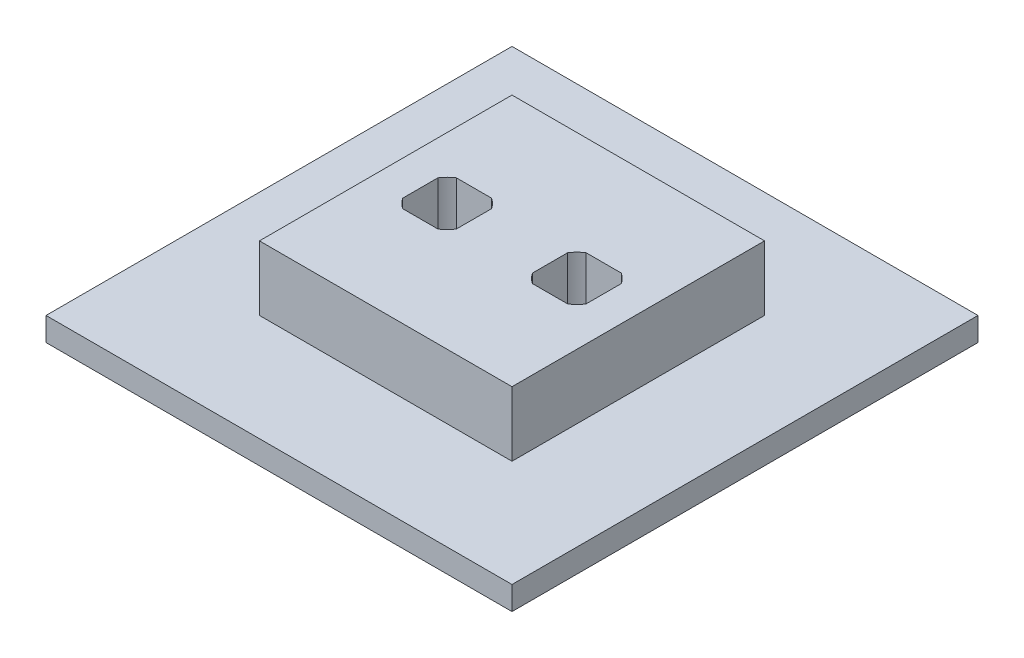
ISO-10303-21;
HEADER;
FILE_DESCRIPTION(('STEP AP214'),'2;1');
FILE_NAME('part.step','',(''),(''),'','','');
FILE_SCHEMA(('AUTOMOTIVE_DESIGN { 1 0 10303 214 1 1 1 1 }'));
ENDSEC;
DATA;
#1=APPLICATION_CONTEXT('core data for automotive mechanical design processes');
#2=APPLICATION_PROTOCOL_DEFINITION('international standard','automotive_design',2000,#1);
#3=PRODUCT_CONTEXT('',#1,'mechanical');
#4=PRODUCT('Part','Part','',(#3));
#5=PRODUCT_RELATED_PRODUCT_CATEGORY('part','',(#4));
#6=PRODUCT_DEFINITION_FORMATION('','',#4);
#7=PRODUCT_DEFINITION_CONTEXT('part definition',#1,'design');
#8=PRODUCT_DEFINITION('design','',#6,#7);
#9=PRODUCT_DEFINITION_SHAPE('','',#8);
#10=(LENGTH_UNIT() NAMED_UNIT(*) SI_UNIT(.MILLI.,.METRE.));
#11=(NAMED_UNIT(*) PLANE_ANGLE_UNIT() SI_UNIT($,.RADIAN.));
#12=(NAMED_UNIT(*) SI_UNIT($,.STERADIAN.) SOLID_ANGLE_UNIT());
#13=UNCERTAINTY_MEASURE_WITH_UNIT(LENGTH_MEASURE(1.E-05),#10,'distance_accuracy_value','');
#14=(GEOMETRIC_REPRESENTATION_CONTEXT(3) GLOBAL_UNCERTAINTY_ASSIGNED_CONTEXT((#13)) GLOBAL_UNIT_ASSIGNED_CONTEXT((#10,
#11,#12)) REPRESENTATION_CONTEXT('',''));
#15=CARTESIAN_POINT('',(0.,0.,0.));
#16=DIRECTION('',(0.,0.,1.));
#17=DIRECTION('',(1.,0.,0.));
#18=AXIS2_PLACEMENT_3D('',#15,#16,#17);
#19=CARTESIAN_POINT('',(28.6385,15.,-39.6875));
#20=DIRECTION('',(0.,-1.,0.));
#21=DIRECTION('',(0.,0.,-1.));
#22=AXIS2_PLACEMENT_3D('',#19,#20,#21);
#23=CYLINDRICAL_SURFACE('',#22,5.46099999999999);
#24=CARTESIAN_POINT('',(28.6385,15.,-39.6875));
#25=DIRECTION('',(0.,1.,0.));
#26=DIRECTION('',(0.,0.,1.));
#27=AXIS2_PLACEMENT_3D('',#24,#25,#26);
#28=CIRCLE('',#27,5.46099999999999);
#29=CARTESIAN_POINT('',(25.6352018130062,15.,-44.2485));
#30=VERTEX_POINT('',#29);
#31=CARTESIAN_POINT('',(24.0775,15.,-42.6907981869937));
#32=VERTEX_POINT('',#31);
#33=EDGE_CURVE('E358',#30,#32,#28,.T.);
#34=ORIENTED_EDGE('',*,*,#33,.T.);
#35=DIRECTION('',(0.,-1.,0.));
#36=VECTOR('',#35,1.);
#37=CARTESIAN_POINT('',(24.0775,15.,-42.6907981869937));
#38=LINE('',#37,#36);
#39=CARTESIAN_POINT('',(24.0775,0.,-42.6907981869937));
#40=VERTEX_POINT('',#39);
#41=EDGE_CURVE('E11',#32,#40,#38,.T.);
#42=ORIENTED_EDGE('',*,*,#41,.T.);
#43=CARTESIAN_POINT('',(28.6385,0.,-39.6875));
#44=DIRECTION('',(0.,1.,0.));
#45=DIRECTION('',(0.,0.,1.));
#46=AXIS2_PLACEMENT_3D('',#43,#44,#45);
#47=CIRCLE('',#46,5.46099999999998);
#48=CARTESIAN_POINT('',(25.6352018130063,0.,-44.2485));
#49=VERTEX_POINT('',#48);
#50=EDGE_CURVE('E414',#49,#40,#47,.T.);
#51=ORIENTED_EDGE('',*,*,#50,.F.);
#52=DIRECTION('',(0.,-1.,0.));
#53=VECTOR('',#52,1.);
#54=CARTESIAN_POINT('',(25.6352018130062,15.,-44.2485));
#55=LINE('',#54,#53);
#56=EDGE_CURVE('E336',#49,#30,#55,.F.);
#57=ORIENTED_EDGE('',*,*,#56,.T.);
#58=EDGE_LOOP('',(#34,#42,#51,#57));
#59=FACE_BOUND('',#58,.T.);
#60=ADVANCED_FACE('F38',(#59),#23,.F.);
#61=CARTESIAN_POINT('',(24.0775,0.,-36.6842018130063));
#62=VERTEX_POINT('',#61);
#63=CARTESIAN_POINT('',(25.6352018130062,0.,-35.1265));
#64=VERTEX_POINT('',#63);
#65=EDGE_CURVE('E229',#62,#64,#47,.T.);
#66=ORIENTED_EDGE('',*,*,#65,.F.);
#67=DIRECTION('',(0.,-1.,0.));
#68=VECTOR('',#67,1.);
#69=CARTESIAN_POINT('',(24.0775,15.,-36.6842018130062));
#70=LINE('',#69,#68);
#71=CARTESIAN_POINT('',(24.0775,15.,-36.6842018130062));
#72=VERTEX_POINT('',#71);
#73=EDGE_CURVE('E46',#62,#72,#70,.F.);
#74=ORIENTED_EDGE('',*,*,#73,.T.);
#75=CARTESIAN_POINT('',(25.6352018130062,15.,-35.1265));
#76=VERTEX_POINT('',#75);
#77=EDGE_CURVE('E238',#72,#76,#28,.T.);
#78=ORIENTED_EDGE('',*,*,#77,.T.);
#79=DIRECTION('',(0.,-1.,0.));
#80=VECTOR('',#79,1.);
#81=CARTESIAN_POINT('',(25.6352018130062,15.,-35.1265));
#82=LINE('',#81,#80);
#83=EDGE_CURVE('E327',#76,#64,#82,.T.);
#84=ORIENTED_EDGE('',*,*,#83,.T.);
#85=EDGE_LOOP('',(#66,#74,#78,#84));
#86=FACE_BOUND('',#85,.T.);
#87=ADVANCED_FACE('F346',(#86),#23,.F.);
#88=CARTESIAN_POINT('',(33.1995,15.,-42.6907981869937));
#89=VERTEX_POINT('',#88);
#90=CARTESIAN_POINT('',(31.6417981869937,15.,-44.2485));
#91=VERTEX_POINT('',#90);
#92=EDGE_CURVE('E244',#89,#91,#28,.T.);
#93=ORIENTED_EDGE('',*,*,#92,.T.);
#94=DIRECTION('',(0.,-1.,0.));
#95=VECTOR('',#94,1.);
#96=CARTESIAN_POINT('',(31.6417981869937,15.,-44.2485));
#97=LINE('',#96,#95);
#98=CARTESIAN_POINT('',(31.6417981869937,0.,-44.2485));
#99=VERTEX_POINT('',#98);
#100=EDGE_CURVE('E339',#91,#99,#97,.T.);
#101=ORIENTED_EDGE('',*,*,#100,.T.);
#102=CARTESIAN_POINT('',(33.1995,0.,-42.6907981869937));
#103=VERTEX_POINT('',#102);
#104=EDGE_CURVE('E412',#103,#99,#47,.T.);
#105=ORIENTED_EDGE('',*,*,#104,.F.);
#106=DIRECTION('',(0.,-1.,0.));
#107=VECTOR('',#106,1.);
#108=CARTESIAN_POINT('',(33.1995,15.,-42.6907981869937));
#109=LINE('',#108,#107);
#110=EDGE_CURVE('E330',#103,#89,#109,.F.);
#111=ORIENTED_EDGE('',*,*,#110,.T.);
#112=EDGE_LOOP('',(#93,#101,#105,#111));
#113=FACE_BOUND('',#112,.T.);
#114=ADVANCED_FACE('F363',(#113),#23,.F.);
#115=CARTESIAN_POINT('',(31.6417981869937,15.,-35.1265));
#116=VERTEX_POINT('',#115);
#117=CARTESIAN_POINT('',(33.1995,15.,-36.6842018130062));
#118=VERTEX_POINT('',#117);
#119=EDGE_CURVE('E240',#116,#118,#28,.T.);
#120=ORIENTED_EDGE('',*,*,#119,.T.);
#121=DIRECTION('',(0.,-1.,0.));
#122=VECTOR('',#121,1.);
#123=CARTESIAN_POINT('',(33.1995,15.,-36.6842018130062));
#124=LINE('',#123,#122);
#125=CARTESIAN_POINT('',(33.1995,0.,-36.6842018130062));
#126=VERTEX_POINT('',#125);
#127=EDGE_CURVE('E333',#118,#126,#124,.T.);
#128=ORIENTED_EDGE('',*,*,#127,.T.);
#129=CARTESIAN_POINT('',(31.6417981869937,0.,-35.1265));
#130=VERTEX_POINT('',#129);
#131=EDGE_CURVE('E233',#130,#126,#47,.T.);
#132=ORIENTED_EDGE('',*,*,#131,.F.);
#133=DIRECTION('',(0.,-1.,0.));
#134=VECTOR('',#133,1.);
#135=CARTESIAN_POINT('',(31.6417981869937,15.,-35.1265));
#136=LINE('',#135,#134);
#137=EDGE_CURVE('E324',#130,#116,#136,.F.);
#138=ORIENTED_EDGE('',*,*,#137,.T.);
#139=EDGE_LOOP('',(#120,#128,#132,#138));
#140=FACE_BOUND('',#139,.T.);
#141=ADVANCED_FACE('F432',(#140),#23,.F.);
#142=CARTESIAN_POINT('',(50.7365,15.,-39.6875));
#143=DIRECTION('',(0.,-1.,0.));
#144=DIRECTION('',(0.,0.,-1.));
#145=AXIS2_PLACEMENT_3D('',#142,#143,#144);
#146=CYLINDRICAL_SURFACE('',#145,5.46099999999998);
#147=CARTESIAN_POINT('',(50.7365,15.,-39.6875));
#148=DIRECTION('',(0.,1.,0.));
#149=DIRECTION('',(0.,0.,1.));
#150=AXIS2_PLACEMENT_3D('',#147,#148,#149);
#151=CIRCLE('',#150,5.46099999999998);
#152=CARTESIAN_POINT('',(47.7332018130063,15.,-44.2485));
#153=VERTEX_POINT('',#152);
#154=CARTESIAN_POINT('',(46.1755,15.,-42.6907981869937));
#155=VERTEX_POINT('',#154);
#156=EDGE_CURVE('E406',#153,#155,#151,.T.);
#157=ORIENTED_EDGE('',*,*,#156,.T.);
#158=DIRECTION('',(0.,-1.,0.));
#159=VECTOR('',#158,1.);
#160=CARTESIAN_POINT('',(46.1755,15.,-42.6907981869937));
#161=LINE('',#160,#159);
#162=CARTESIAN_POINT('',(46.1755,0.,-42.6907981869937));
#163=VERTEX_POINT('',#162);
#164=EDGE_CURVE('E321',#155,#163,#161,.T.);
#165=ORIENTED_EDGE('',*,*,#164,.T.);
#166=CARTESIAN_POINT('',(50.7365,0.,-39.6875));
#167=DIRECTION('',(0.,1.,0.));
#168=DIRECTION('',(0.,0.,1.));
#169=AXIS2_PLACEMENT_3D('',#166,#167,#168);
#170=CIRCLE('',#169,5.46099999999998);
#171=CARTESIAN_POINT('',(47.7332018130063,0.,-44.2485));
#172=VERTEX_POINT('',#171);
#173=EDGE_CURVE('E227',#172,#163,#170,.T.);
#174=ORIENTED_EDGE('',*,*,#173,.F.);
#175=DIRECTION('',(0.,-1.,0.));
#176=VECTOR('',#175,1.);
#177=CARTESIAN_POINT('',(47.7332018130063,15.,-44.2485));
#178=LINE('',#177,#176);
#179=EDGE_CURVE('E204',#172,#153,#178,.F.);
#180=ORIENTED_EDGE('',*,*,#179,.T.);
#181=EDGE_LOOP('',(#157,#165,#174,#180));
#182=FACE_BOUND('',#181,.T.);
#183=ADVANCED_FACE('F439',(#182),#146,.F.);
#184=CARTESIAN_POINT('',(46.1755,0.,-36.6842018130062));
#185=VERTEX_POINT('',#184);
#186=CARTESIAN_POINT('',(47.7332018130063,0.,-35.1265));
#187=VERTEX_POINT('',#186);
#188=EDGE_CURVE('E230',#185,#187,#170,.T.);
#189=ORIENTED_EDGE('',*,*,#188,.F.);
#190=DIRECTION('',(0.,-1.,0.));
#191=VECTOR('',#190,1.);
#192=CARTESIAN_POINT('',(46.1755,15.,-36.6842018130062));
#193=LINE('',#192,#191);
#194=CARTESIAN_POINT('',(46.1755,15.,-36.6842018130062));
#195=VERTEX_POINT('',#194);
#196=EDGE_CURVE('E220',#185,#195,#193,.F.);
#197=ORIENTED_EDGE('',*,*,#196,.T.);
#198=CARTESIAN_POINT('',(47.7332018130063,15.,-35.1265));
#199=VERTEX_POINT('',#198);
#200=EDGE_CURVE('E239',#195,#199,#151,.T.);
#201=ORIENTED_EDGE('',*,*,#200,.T.);
#202=DIRECTION('',(0.,-1.,0.));
#203=VECTOR('',#202,1.);
#204=CARTESIAN_POINT('',(47.7332018130063,15.,-35.1265));
#205=LINE('',#204,#203);
#206=EDGE_CURVE('E310',#199,#187,#205,.T.);
#207=ORIENTED_EDGE('',*,*,#206,.T.);
#208=EDGE_LOOP('',(#189,#197,#201,#207));
#209=FACE_BOUND('',#208,.T.);
#210=ADVANCED_FACE('F445',(#209),#146,.F.);
#211=CARTESIAN_POINT('',(55.2975,15.,-42.6907981869937));
#212=VERTEX_POINT('',#211);
#213=CARTESIAN_POINT('',(53.7397981869937,15.,-44.2485));
#214=VERTEX_POINT('',#213);
#215=EDGE_CURVE('E219',#212,#214,#151,.T.);
#216=ORIENTED_EDGE('',*,*,#215,.T.);
#217=DIRECTION('',(0.,-1.,0.));
#218=VECTOR('',#217,1.);
#219=CARTESIAN_POINT('',(53.7397981869937,15.,-44.2485));
#220=LINE('',#219,#218);
#221=CARTESIAN_POINT('',(53.7397981869937,0.,-44.2485));
#222=VERTEX_POINT('',#221);
#223=EDGE_CURVE('E201',#214,#222,#220,.T.);
#224=ORIENTED_EDGE('',*,*,#223,.T.);
#225=CARTESIAN_POINT('',(55.2975,0.,-42.6907981869937));
#226=VERTEX_POINT('',#225);
#227=EDGE_CURVE('E217',#226,#222,#170,.T.);
#228=ORIENTED_EDGE('',*,*,#227,.F.);
#229=DIRECTION('',(0.,-1.,0.));
#230=VECTOR('',#229,1.);
#231=CARTESIAN_POINT('',(55.2975,15.,-42.6907981869937));
#232=LINE('',#231,#230);
#233=EDGE_CURVE('E313',#226,#212,#232,.F.);
#234=ORIENTED_EDGE('',*,*,#233,.T.);
#235=EDGE_LOOP('',(#216,#224,#228,#234));
#236=FACE_BOUND('',#235,.T.);
#237=ADVANCED_FACE('F215',(#236),#146,.F.);
#238=CARTESIAN_POINT('',(53.7397981869937,15.,-35.1265));
#239=VERTEX_POINT('',#238);
#240=CARTESIAN_POINT('',(55.2975,15.,-36.6842018130063));
#241=VERTEX_POINT('',#240);
#242=EDGE_CURVE('E235',#239,#241,#151,.T.);
#243=ORIENTED_EDGE('',*,*,#242,.T.);
#244=DIRECTION('',(0.,-1.,0.));
#245=VECTOR('',#244,1.);
#246=CARTESIAN_POINT('',(55.2975,15.,-36.6842018130063));
#247=LINE('',#246,#245);
#248=CARTESIAN_POINT('',(55.2975,0.,-36.6842018130063));
#249=VERTEX_POINT('',#248);
#250=EDGE_CURVE('E315',#241,#249,#247,.T.);
#251=ORIENTED_EDGE('',*,*,#250,.T.);
#252=CARTESIAN_POINT('',(53.7397981869937,0.,-35.1265));
#253=VERTEX_POINT('',#252);
#254=EDGE_CURVE('E226',#253,#249,#170,.T.);
#255=ORIENTED_EDGE('',*,*,#254,.F.);
#256=DIRECTION('',(0.,-1.,0.));
#257=VECTOR('',#256,1.);
#258=CARTESIAN_POINT('',(53.7397981869937,15.,-35.1265));
#259=LINE('',#258,#257);
#260=EDGE_CURVE('E307',#253,#239,#259,.F.);
#261=ORIENTED_EDGE('',*,*,#260,.T.);
#262=EDGE_LOOP('',(#243,#251,#255,#261));
#263=FACE_BOUND('',#262,.T.);
#264=ADVANCED_FACE('F400',(#263),#146,.F.);
#265=CARTESIAN_POINT('',(0.,4.,0.));
#266=DIRECTION('',(1.,0.,0.));
#267=DIRECTION('',(0.,0.,-1.));
#268=AXIS2_PLACEMENT_3D('',#265,#266,#267);
#269=PLANE('',#268);
#270=DIRECTION('',(0.,0.,1.));
#271=VECTOR('',#270,1.);
#272=CARTESIAN_POINT('',(0.,0.,0.));
#273=LINE('',#272,#271);
#274=CARTESIAN_POINT('',(0.,0.,-79.375));
#275=VERTEX_POINT('',#274);
#276=CARTESIAN_POINT('',(0.,0.,0.));
#277=VERTEX_POINT('',#276);
#278=EDGE_CURVE('E277',#275,#277,#273,.T.);
#279=ORIENTED_EDGE('',*,*,#278,.T.);
#280=DIRECTION('',(0.,-1.,0.));
#281=VECTOR('',#280,1.);
#282=CARTESIAN_POINT('',(0.,4.,0.));
#283=LINE('',#282,#281);
#284=CARTESIAN_POINT('',(0.,4.,0.));
#285=VERTEX_POINT('',#284);
#286=EDGE_CURVE('E304',#285,#277,#283,.T.);
#287=ORIENTED_EDGE('',*,*,#286,.F.);
#288=DIRECTION('',(0.,0.,1.));
#289=VECTOR('',#288,1.);
#290=CARTESIAN_POINT('',(0.,4.,0.));
#291=LINE('',#290,#289);
#292=CARTESIAN_POINT('',(0.,4.,-79.375));
#293=VERTEX_POINT('',#292);
#294=EDGE_CURVE('E278',#293,#285,#291,.T.);
#295=ORIENTED_EDGE('',*,*,#294,.F.);
#296=DIRECTION('',(0.,-1.,0.));
#297=VECTOR('',#296,1.);
#298=CARTESIAN_POINT('',(0.,4.,-79.375));
#299=LINE('',#298,#297);
#300=EDGE_CURVE('E288',#293,#275,#299,.T.);
#301=ORIENTED_EDGE('',*,*,#300,.T.);
#302=EDGE_LOOP('',(#279,#287,#295,#301));
#303=FACE_BOUND('',#302,.T.);
#304=ADVANCED_FACE('F40',(#303),#269,.F.);
#305=CARTESIAN_POINT('',(0.,4.,0.));
#306=DIRECTION('',(0.,0.,-1.));
#307=DIRECTION('',(-1.,0.,0.));
#308=AXIS2_PLACEMENT_3D('',#305,#306,#307);
#309=PLANE('',#308);
#310=DIRECTION('',(1.,0.,0.));
#311=VECTOR('',#310,1.);
#312=CARTESIAN_POINT('',(0.,0.,0.));
#313=LINE('',#312,#311);
#314=CARTESIAN_POINT('',(79.375,0.,0.));
#315=VERTEX_POINT('',#314);
#316=EDGE_CURVE('E291',#277,#315,#313,.T.);
#317=ORIENTED_EDGE('',*,*,#316,.T.);
#318=DIRECTION('',(0.,-1.,0.));
#319=VECTOR('',#318,1.);
#320=CARTESIAN_POINT('',(79.375,4.,0.));
#321=LINE('',#320,#319);
#322=CARTESIAN_POINT('',(79.375,4.,0.));
#323=VERTEX_POINT('',#322);
#324=EDGE_CURVE('E301',#323,#315,#321,.T.);
#325=ORIENTED_EDGE('',*,*,#324,.F.);
#326=DIRECTION('',(1.,0.,0.));
#327=VECTOR('',#326,1.);
#328=CARTESIAN_POINT('',(0.,4.,0.));
#329=LINE('',#328,#327);
#330=EDGE_CURVE('E281',#285,#323,#329,.T.);
#331=ORIENTED_EDGE('',*,*,#330,.F.);
#332=ORIENTED_EDGE('',*,*,#286,.T.);
#333=EDGE_LOOP('',(#317,#325,#331,#332));
#334=FACE_BOUND('',#333,.T.);
#335=ADVANCED_FACE('F644',(#334),#309,.F.);
#336=CARTESIAN_POINT('',(79.375,4.,0.));
#337=DIRECTION('',(-1.,0.,0.));
#338=DIRECTION('',(0.,0.,1.));
#339=AXIS2_PLACEMENT_3D('',#336,#337,#338);
#340=PLANE('',#339);
#341=DIRECTION('',(0.,0.,-1.));
#342=VECTOR('',#341,1.);
#343=CARTESIAN_POINT('',(79.375,0.,0.));
#344=LINE('',#343,#342);
#345=CARTESIAN_POINT('',(79.375,0.,-79.375));
#346=VERTEX_POINT('',#345);
#347=EDGE_CURVE('E293',#315,#346,#344,.T.);
#348=ORIENTED_EDGE('',*,*,#347,.T.);
#349=DIRECTION('',(0.,-1.,0.));
#350=VECTOR('',#349,1.);
#351=CARTESIAN_POINT('',(79.375,4.,-79.375));
#352=LINE('',#351,#350);
#353=CARTESIAN_POINT('',(79.375,4.,-79.375));
#354=VERTEX_POINT('',#353);
#355=EDGE_CURVE('E298',#354,#346,#352,.T.);
#356=ORIENTED_EDGE('',*,*,#355,.F.);
#357=DIRECTION('',(0.,0.,-1.));
#358=VECTOR('',#357,1.);
#359=CARTESIAN_POINT('',(79.375,4.,0.));
#360=LINE('',#359,#358);
#361=EDGE_CURVE('E284',#323,#354,#360,.T.);
#362=ORIENTED_EDGE('',*,*,#361,.F.);
#363=ORIENTED_EDGE('',*,*,#324,.T.);
#364=EDGE_LOOP('',(#348,#356,#362,#363));
#365=FACE_BOUND('',#364,.T.);
#366=ADVANCED_FACE('F634',(#365),#340,.F.);
#367=CARTESIAN_POINT('',(0.,4.,-79.375));
#368=DIRECTION('',(0.,0.,1.));
#369=DIRECTION('',(1.,0.,0.));
#370=AXIS2_PLACEMENT_3D('',#367,#368,#369);
#371=PLANE('',#370);
#372=DIRECTION('',(-1.,0.,0.));
#373=VECTOR('',#372,1.);
#374=CARTESIAN_POINT('',(0.,0.,-79.375));
#375=LINE('',#374,#373);
#376=EDGE_CURVE('E282',#346,#275,#375,.T.);
#377=ORIENTED_EDGE('',*,*,#376,.T.);
#378=ORIENTED_EDGE('',*,*,#300,.F.);
#379=DIRECTION('',(-1.,0.,0.));
#380=VECTOR('',#379,1.);
#381=CARTESIAN_POINT('',(0.,4.,-79.375));
#382=LINE('',#381,#380);
#383=EDGE_CURVE('E286',#354,#293,#382,.T.);
#384=ORIENTED_EDGE('',*,*,#383,.F.);
#385=ORIENTED_EDGE('',*,*,#355,.T.);
#386=EDGE_LOOP('',(#377,#378,#384,#385));
#387=FACE_BOUND('',#386,.T.);
#388=ADVANCED_FACE('F624',(#387),#371,.F.);
#389=CARTESIAN_POINT('',(0.,4.,0.));
#390=DIRECTION('',(0.,-1.,0.));
#391=DIRECTION('',(0.,0.,-1.));
#392=AXIS2_PLACEMENT_3D('',#389,#390,#391);
#393=PLANE('',#392);
#394=DIRECTION('',(0.,0.,1.));
#395=VECTOR('',#394,1.);
#396=CARTESIAN_POINT('',(18.1775,4.,-18.1775));
#397=LINE('',#396,#395);
#398=CARTESIAN_POINT('',(18.1775,4.,-61.1975));
#399=VERTEX_POINT('',#398);
#400=CARTESIAN_POINT('',(18.1775,4.,-18.1775));
#401=VERTEX_POINT('',#400);
#402=EDGE_CURVE('E243',#399,#401,#397,.T.);
#403=ORIENTED_EDGE('',*,*,#402,.F.);
#404=DIRECTION('',(-1.,0.,0.));
#405=VECTOR('',#404,1.);
#406=CARTESIAN_POINT('',(18.1775,4.,-61.1975));
#407=LINE('',#406,#405);
#408=CARTESIAN_POINT('',(61.1975,4.,-61.1975));
#409=VERTEX_POINT('',#408);
#410=EDGE_CURVE('E249',#409,#399,#407,.T.);
#411=ORIENTED_EDGE('',*,*,#410,.F.);
#412=DIRECTION('',(0.,0.,-1.));
#413=VECTOR('',#412,1.);
#414=CARTESIAN_POINT('',(61.1975,4.,-18.1775));
#415=LINE('',#414,#413);
#416=CARTESIAN_POINT('',(61.1975,4.,-18.1775));
#417=VERTEX_POINT('',#416);
#418=EDGE_CURVE('E261',#417,#409,#415,.T.);
#419=ORIENTED_EDGE('',*,*,#418,.F.);
#420=DIRECTION('',(1.,0.,0.));
#421=VECTOR('',#420,1.);
#422=CARTESIAN_POINT('',(18.1775,4.,-18.1775));
#423=LINE('',#422,#421);
#424=EDGE_CURVE('E258',#401,#417,#423,.T.);
#425=ORIENTED_EDGE('',*,*,#424,.F.);
#426=EDGE_LOOP('',(#403,#411,#419,#425));
#427=FACE_BOUND('',#426,.T.);
#428=ORIENTED_EDGE('',*,*,#294,.T.);
#429=ORIENTED_EDGE('',*,*,#330,.T.);
#430=ORIENTED_EDGE('',*,*,#361,.T.);
#431=ORIENTED_EDGE('',*,*,#383,.T.);
#432=EDGE_LOOP('',(#428,#429,#430,#431));
#433=FACE_BOUND('',#432,.T.);
#434=ADVANCED_FACE('F521',(#427,#433),#393,.F.);
#435=CARTESIAN_POINT('',(0.,0.,0.));
#436=DIRECTION('',(0.,-1.,0.));
#437=DIRECTION('',(0.,0.,-1.));
#438=AXIS2_PLACEMENT_3D('',#435,#436,#437);
#439=PLANE('',#438);
#440=ORIENTED_EDGE('',*,*,#278,.F.);
#441=ORIENTED_EDGE('',*,*,#376,.F.);
#442=ORIENTED_EDGE('',*,*,#347,.F.);
#443=ORIENTED_EDGE('',*,*,#316,.F.);
#444=EDGE_LOOP('',(#440,#441,#442,#443));
#445=FACE_BOUND('',#444,.T.);
#446=DIRECTION('',(0.,0.,1.));
#447=VECTOR('',#446,1.);
#448=CARTESIAN_POINT('',(24.0775,0.,-35.1265));
#449=LINE('',#448,#447);
#450=EDGE_CURVE('E53',#40,#62,#449,.T.);
#451=ORIENTED_EDGE('',*,*,#450,.T.);
#452=ORIENTED_EDGE('',*,*,#65,.T.);
#453=DIRECTION('',(1.,0.,0.));
#454=VECTOR('',#453,1.);
#455=CARTESIAN_POINT('',(24.0775,0.,-35.1265));
#456=LINE('',#455,#454);
#457=EDGE_CURVE('E384',#64,#130,#456,.T.);
#458=ORIENTED_EDGE('',*,*,#457,.T.);
#459=ORIENTED_EDGE('',*,*,#131,.T.);
#460=DIRECTION('',(0.,0.,-1.));
#461=VECTOR('',#460,1.);
#462=CARTESIAN_POINT('',(33.1995,0.,-35.1265));
#463=LINE('',#462,#461);
#464=EDGE_CURVE('E386',#126,#103,#463,.T.);
#465=ORIENTED_EDGE('',*,*,#464,.T.);
#466=ORIENTED_EDGE('',*,*,#104,.T.);
#467=DIRECTION('',(-1.,0.,0.));
#468=VECTOR('',#467,1.);
#469=CARTESIAN_POINT('',(24.0775,0.,-44.2485));
#470=LINE('',#469,#468);
#471=EDGE_CURVE('E59',#99,#49,#470,.T.);
#472=ORIENTED_EDGE('',*,*,#471,.T.);
#473=ORIENTED_EDGE('',*,*,#50,.T.);
#474=EDGE_LOOP('',(#451,#452,#458,#459,#465,#466,#472,#473));
#475=FACE_BOUND('',#474,.T.);
#476=DIRECTION('',(0.,0.,1.));
#477=VECTOR('',#476,1.);
#478=CARTESIAN_POINT('',(46.1755,0.,-44.2485));
#479=LINE('',#478,#477);
#480=EDGE_CURVE('E209',#163,#185,#479,.T.);
#481=ORIENTED_EDGE('',*,*,#480,.T.);
#482=ORIENTED_EDGE('',*,*,#188,.T.);
#483=DIRECTION('',(1.,0.,0.));
#484=VECTOR('',#483,1.);
#485=CARTESIAN_POINT('',(46.1755,0.,-35.1265));
#486=LINE('',#485,#484);
#487=EDGE_CURVE('E388',#187,#253,#486,.T.);
#488=ORIENTED_EDGE('',*,*,#487,.T.);
#489=ORIENTED_EDGE('',*,*,#254,.T.);
#490=DIRECTION('',(0.,0.,-1.));
#491=VECTOR('',#490,1.);
#492=CARTESIAN_POINT('',(55.2975,0.,-44.2485));
#493=LINE('',#492,#491);
#494=EDGE_CURVE('E224',#249,#226,#493,.T.);
#495=ORIENTED_EDGE('',*,*,#494,.T.);
#496=ORIENTED_EDGE('',*,*,#227,.T.);
#497=DIRECTION('',(-1.,0.,0.));
#498=VECTOR('',#497,1.);
#499=CARTESIAN_POINT('',(46.1755,0.,-44.2485));
#500=LINE('',#499,#498);
#501=EDGE_CURVE('E198',#222,#172,#500,.T.);
#502=ORIENTED_EDGE('',*,*,#501,.T.);
#503=ORIENTED_EDGE('',*,*,#173,.T.);
#504=EDGE_LOOP('',(#481,#482,#488,#489,#495,#496,#502,#503));
#505=FACE_BOUND('',#504,.T.);
#506=ADVANCED_FACE('F222',(#445,#475,#505),#439,.T.);
#507=CARTESIAN_POINT('',(0.,15.,0.));
#508=DIRECTION('',(0.,-1.,0.));
#509=DIRECTION('',(0.,0.,-1.));
#510=AXIS2_PLACEMENT_3D('',#507,#508,#509);
#511=PLANE('',#510);
#512=DIRECTION('',(0.,0.,1.));
#513=VECTOR('',#512,1.);
#514=CARTESIAN_POINT('',(18.1775,15.,-18.1775));
#515=LINE('',#514,#513);
#516=CARTESIAN_POINT('',(18.1775,15.,-61.1975));
#517=VERTEX_POINT('',#516);
#518=CARTESIAN_POINT('',(18.1775,15.,-18.1775));
#519=VERTEX_POINT('',#518);
#520=EDGE_CURVE('E245',#517,#519,#515,.T.);
#521=ORIENTED_EDGE('',*,*,#520,.T.);
#522=DIRECTION('',(1.,0.,0.));
#523=VECTOR('',#522,1.);
#524=CARTESIAN_POINT('',(18.1775,15.,-18.1775));
#525=LINE('',#524,#523);
#526=CARTESIAN_POINT('',(61.1975,15.,-18.1775));
#527=VERTEX_POINT('',#526);
#528=EDGE_CURVE('E248',#519,#527,#525,.T.);
#529=ORIENTED_EDGE('',*,*,#528,.T.);
#530=DIRECTION('',(0.,0.,-1.));
#531=VECTOR('',#530,1.);
#532=CARTESIAN_POINT('',(61.1975,15.,-18.1775));
#533=LINE('',#532,#531);
#534=CARTESIAN_POINT('',(61.1975,15.,-61.1975));
#535=VERTEX_POINT('',#534);
#536=EDGE_CURVE('E251',#527,#535,#533,.T.);
#537=ORIENTED_EDGE('',*,*,#536,.T.);
#538=DIRECTION('',(-1.,0.,0.));
#539=VECTOR('',#538,1.);
#540=CARTESIAN_POINT('',(18.1775,15.,-61.1975));
#541=LINE('',#540,#539);
#542=EDGE_CURVE('E253',#535,#517,#541,.T.);
#543=ORIENTED_EDGE('',*,*,#542,.T.);
#544=EDGE_LOOP('',(#521,#529,#537,#543));
#545=FACE_BOUND('',#544,.T.);
#546=ORIENTED_EDGE('',*,*,#77,.F.);
#547=DIRECTION('',(0.,0.,1.));
#548=VECTOR('',#547,1.);
#549=CARTESIAN_POINT('',(24.0775,15.,-35.1265));
#550=LINE('',#549,#548);
#551=EDGE_CURVE('E354',#32,#72,#550,.T.);
#552=ORIENTED_EDGE('',*,*,#551,.F.);
#553=ORIENTED_EDGE('',*,*,#33,.F.);
#554=DIRECTION('',(-1.,0.,0.));
#555=VECTOR('',#554,1.);
#556=CARTESIAN_POINT('',(24.0775,15.,-44.2485));
#557=LINE('',#556,#555);
#558=EDGE_CURVE('E369',#91,#30,#557,.T.);
#559=ORIENTED_EDGE('',*,*,#558,.F.);
#560=ORIENTED_EDGE('',*,*,#92,.F.);
#561=DIRECTION('',(0.,0.,-1.));
#562=VECTOR('',#561,1.);
#563=CARTESIAN_POINT('',(33.1995,15.,-35.1265));
#564=LINE('',#563,#562);
#565=EDGE_CURVE('E368',#118,#89,#564,.T.);
#566=ORIENTED_EDGE('',*,*,#565,.F.);
#567=ORIENTED_EDGE('',*,*,#119,.F.);
#568=DIRECTION('',(1.,0.,0.));
#569=VECTOR('',#568,1.);
#570=CARTESIAN_POINT('',(24.0775,15.,-35.1265));
#571=LINE('',#570,#569);
#572=EDGE_CURVE('E357',#76,#116,#571,.T.);
#573=ORIENTED_EDGE('',*,*,#572,.F.);
#574=EDGE_LOOP('',(#546,#552,#553,#559,#560,#566,#567,#573));
#575=FACE_BOUND('',#574,.T.);
#576=ORIENTED_EDGE('',*,*,#200,.F.);
#577=DIRECTION('',(0.,0.,1.));
#578=VECTOR('',#577,1.);
#579=CARTESIAN_POINT('',(46.1755,15.,-44.2485));
#580=LINE('',#579,#578);
#581=EDGE_CURVE('E375',#155,#195,#580,.T.);
#582=ORIENTED_EDGE('',*,*,#581,.F.);
#583=ORIENTED_EDGE('',*,*,#156,.F.);
#584=DIRECTION('',(-1.,0.,0.));
#585=VECTOR('',#584,1.);
#586=CARTESIAN_POINT('',(46.1755,15.,-44.2485));
#587=LINE('',#586,#585);
#588=EDGE_CURVE('E377',#214,#153,#587,.T.);
#589=ORIENTED_EDGE('',*,*,#588,.F.);
#590=ORIENTED_EDGE('',*,*,#215,.F.);
#591=DIRECTION('',(0.,0.,-1.));
#592=VECTOR('',#591,1.);
#593=CARTESIAN_POINT('',(55.2975,15.,-44.2485));
#594=LINE('',#593,#592);
#595=EDGE_CURVE('E379',#241,#212,#594,.T.);
#596=ORIENTED_EDGE('',*,*,#595,.F.);
#597=ORIENTED_EDGE('',*,*,#242,.F.);
#598=DIRECTION('',(1.,0.,0.));
#599=VECTOR('',#598,1.);
#600=CARTESIAN_POINT('',(46.1755,15.,-35.1265));
#601=LINE('',#600,#599);
#602=EDGE_CURVE('E210',#199,#239,#601,.T.);
#603=ORIENTED_EDGE('',*,*,#602,.F.);
#604=EDGE_LOOP('',(#576,#582,#583,#589,#590,#596,#597,#603));
#605=FACE_BOUND('',#604,.T.);
#606=ADVANCED_FACE('F351',(#545,#575,#605),#511,.F.);
#607=CARTESIAN_POINT('',(18.1775,15.,-18.1775));
#608=DIRECTION('',(1.,0.,0.));
#609=DIRECTION('',(0.,0.,-1.));
#610=AXIS2_PLACEMENT_3D('',#607,#608,#609);
#611=PLANE('',#610);
#612=ORIENTED_EDGE('',*,*,#402,.T.);
#613=DIRECTION('',(0.,-1.,0.));
#614=VECTOR('',#613,1.);
#615=CARTESIAN_POINT('',(18.1775,15.,-18.1775));
#616=LINE('',#615,#614);
#617=EDGE_CURVE('E274',#519,#401,#616,.T.);
#618=ORIENTED_EDGE('',*,*,#617,.F.);
#619=ORIENTED_EDGE('',*,*,#520,.F.);
#620=DIRECTION('',(0.,-1.,0.));
#621=VECTOR('',#620,1.);
#622=CARTESIAN_POINT('',(18.1775,15.,-61.1975));
#623=LINE('',#622,#621);
#624=EDGE_CURVE('E255',#517,#399,#623,.T.);
#625=ORIENTED_EDGE('',*,*,#624,.T.);
#626=EDGE_LOOP('',(#612,#618,#619,#625));
#627=FACE_BOUND('',#626,.T.);
#628=ADVANCED_FACE('F510',(#627),#611,.F.);
#629=CARTESIAN_POINT('',(18.1775,15.,-18.1775));
#630=DIRECTION('',(0.,0.,-1.));
#631=DIRECTION('',(-1.,0.,0.));
#632=AXIS2_PLACEMENT_3D('',#629,#630,#631);
#633=PLANE('',#632);
#634=ORIENTED_EDGE('',*,*,#424,.T.);
#635=DIRECTION('',(0.,-1.,0.));
#636=VECTOR('',#635,1.);
#637=CARTESIAN_POINT('',(61.1975,15.,-18.1775));
#638=LINE('',#637,#636);
#639=EDGE_CURVE('E271',#527,#417,#638,.T.);
#640=ORIENTED_EDGE('',*,*,#639,.F.);
#641=ORIENTED_EDGE('',*,*,#528,.F.);
#642=ORIENTED_EDGE('',*,*,#617,.T.);
#643=EDGE_LOOP('',(#634,#640,#641,#642));
#644=FACE_BOUND('',#643,.T.);
#645=ADVANCED_FACE('F598',(#644),#633,.F.);
#646=CARTESIAN_POINT('',(61.1975,15.,-18.1775));
#647=DIRECTION('',(-1.,0.,0.));
#648=DIRECTION('',(0.,0.,1.));
#649=AXIS2_PLACEMENT_3D('',#646,#647,#648);
#650=PLANE('',#649);
#651=ORIENTED_EDGE('',*,*,#418,.T.);
#652=DIRECTION('',(0.,-1.,0.));
#653=VECTOR('',#652,1.);
#654=CARTESIAN_POINT('',(61.1975,15.,-61.1975));
#655=LINE('',#654,#653);
#656=EDGE_CURVE('E268',#535,#409,#655,.T.);
#657=ORIENTED_EDGE('',*,*,#656,.F.);
#658=ORIENTED_EDGE('',*,*,#536,.F.);
#659=ORIENTED_EDGE('',*,*,#639,.T.);
#660=EDGE_LOOP('',(#651,#657,#658,#659));
#661=FACE_BOUND('',#660,.T.);
#662=ADVANCED_FACE('F588',(#661),#650,.F.);
#663=CARTESIAN_POINT('',(18.1775,15.,-61.1975));
#664=DIRECTION('',(0.,0.,1.));
#665=DIRECTION('',(1.,0.,0.));
#666=AXIS2_PLACEMENT_3D('',#663,#664,#665);
#667=PLANE('',#666);
#668=ORIENTED_EDGE('',*,*,#410,.T.);
#669=ORIENTED_EDGE('',*,*,#624,.F.);
#670=ORIENTED_EDGE('',*,*,#542,.F.);
#671=ORIENTED_EDGE('',*,*,#656,.T.);
#672=EDGE_LOOP('',(#668,#669,#670,#671));
#673=FACE_BOUND('',#672,.T.);
#674=ADVANCED_FACE('F500',(#673),#667,.F.);
#675=CARTESIAN_POINT('',(46.1755,-42.7359786462698,-44.2485));
#676=DIRECTION('',(0.,0.,-1.));
#677=DIRECTION('',(-1.,0.,0.));
#678=AXIS2_PLACEMENT_3D('',#675,#676,#677);
#679=PLANE('',#678);
#680=ORIENTED_EDGE('',*,*,#223,.F.);
#681=ORIENTED_EDGE('',*,*,#588,.T.);
#682=ORIENTED_EDGE('',*,*,#179,.F.);
#683=ORIENTED_EDGE('',*,*,#501,.F.);
#684=EDGE_LOOP('',(#680,#681,#682,#683));
#685=FACE_BOUND('',#684,.T.);
#686=ADVANCED_FACE('F200',(#685),#679,.F.);
#687=CARTESIAN_POINT('',(46.1755,-42.7359786462698,-44.2485));
#688=DIRECTION('',(-1.,0.,0.));
#689=DIRECTION('',(0.,0.,1.));
#690=AXIS2_PLACEMENT_3D('',#687,#688,#689);
#691=PLANE('',#690);
#692=ORIENTED_EDGE('',*,*,#164,.F.);
#693=ORIENTED_EDGE('',*,*,#581,.T.);
#694=ORIENTED_EDGE('',*,*,#196,.F.);
#695=ORIENTED_EDGE('',*,*,#480,.F.);
#696=EDGE_LOOP('',(#692,#693,#694,#695));
#697=FACE_BOUND('',#696,.T.);
#698=ADVANCED_FACE('F483',(#697),#691,.F.);
#699=CARTESIAN_POINT('',(46.1755,-42.7359786462698,-35.1265));
#700=DIRECTION('',(0.,0.,1.));
#701=DIRECTION('',(1.,0.,0.));
#702=AXIS2_PLACEMENT_3D('',#699,#700,#701);
#703=PLANE('',#702);
#704=ORIENTED_EDGE('',*,*,#206,.F.);
#705=ORIENTED_EDGE('',*,*,#602,.T.);
#706=ORIENTED_EDGE('',*,*,#260,.F.);
#707=ORIENTED_EDGE('',*,*,#487,.F.);
#708=EDGE_LOOP('',(#704,#705,#706,#707));
#709=FACE_BOUND('',#708,.T.);
#710=ADVANCED_FACE('F396',(#709),#703,.F.);
#711=CARTESIAN_POINT('',(55.2975,-42.7359786462698,-44.2485));
#712=DIRECTION('',(1.,0.,0.));
#713=DIRECTION('',(0.,0.,-1.));
#714=AXIS2_PLACEMENT_3D('',#711,#712,#713);
#715=PLANE('',#714);
#716=ORIENTED_EDGE('',*,*,#250,.F.);
#717=ORIENTED_EDGE('',*,*,#595,.T.);
#718=ORIENTED_EDGE('',*,*,#233,.F.);
#719=ORIENTED_EDGE('',*,*,#494,.F.);
#720=EDGE_LOOP('',(#716,#717,#718,#719));
#721=FACE_BOUND('',#720,.T.);
#722=ADVANCED_FACE('F403',(#721),#715,.F.);
#723=CARTESIAN_POINT('',(24.0775,-42.7359786462698,-44.2485));
#724=DIRECTION('',(0.,0.,-1.));
#725=DIRECTION('',(-1.,0.,0.));
#726=AXIS2_PLACEMENT_3D('',#723,#724,#725);
#727=PLANE('',#726);
#728=ORIENTED_EDGE('',*,*,#100,.F.);
#729=ORIENTED_EDGE('',*,*,#558,.T.);
#730=ORIENTED_EDGE('',*,*,#56,.F.);
#731=ORIENTED_EDGE('',*,*,#471,.F.);
#732=EDGE_LOOP('',(#728,#729,#730,#731));
#733=FACE_BOUND('',#732,.T.);
#734=ADVANCED_FACE('F419',(#733),#727,.F.);
#735=CARTESIAN_POINT('',(24.0775,-42.7359786462698,-35.1265));
#736=DIRECTION('',(-1.,0.,0.));
#737=DIRECTION('',(0.,0.,1.));
#738=AXIS2_PLACEMENT_3D('',#735,#736,#737);
#739=PLANE('',#738);
#740=ORIENTED_EDGE('',*,*,#41,.F.);
#741=ORIENTED_EDGE('',*,*,#551,.T.);
#742=ORIENTED_EDGE('',*,*,#73,.F.);
#743=ORIENTED_EDGE('',*,*,#450,.F.);
#744=EDGE_LOOP('',(#740,#741,#742,#743));
#745=FACE_BOUND('',#744,.T.);
#746=ADVANCED_FACE('F416',(#745),#739,.F.);
#747=CARTESIAN_POINT('',(24.0775,-42.7359786462698,-35.1265));
#748=DIRECTION('',(0.,0.,1.));
#749=DIRECTION('',(1.,0.,0.));
#750=AXIS2_PLACEMENT_3D('',#747,#748,#749);
#751=PLANE('',#750);
#752=ORIENTED_EDGE('',*,*,#83,.F.);
#753=ORIENTED_EDGE('',*,*,#572,.T.);
#754=ORIENTED_EDGE('',*,*,#137,.F.);
#755=ORIENTED_EDGE('',*,*,#457,.F.);
#756=EDGE_LOOP('',(#752,#753,#754,#755));
#757=FACE_BOUND('',#756,.T.);
#758=ADVANCED_FACE('F418',(#757),#751,.F.);
#759=CARTESIAN_POINT('',(33.1995,-42.7359786462698,-35.1265));
#760=DIRECTION('',(1.,0.,0.));
#761=DIRECTION('',(0.,0.,-1.));
#762=AXIS2_PLACEMENT_3D('',#759,#760,#761);
#763=PLANE('',#762);
#764=ORIENTED_EDGE('',*,*,#127,.F.);
#765=ORIENTED_EDGE('',*,*,#565,.T.);
#766=ORIENTED_EDGE('',*,*,#110,.F.);
#767=ORIENTED_EDGE('',*,*,#464,.F.);
#768=EDGE_LOOP('',(#764,#765,#766,#767));
#769=FACE_BOUND('',#768,.T.);
#770=ADVANCED_FACE('F425',(#769),#763,.F.);
#771=CLOSED_SHELL('',(#60,#87,#114,#141,#183,#210,#237,#264,#304,#335,#366,#388,#434,#506,#606,
#628,#645,#662,#674,#686,#698,#710,#722,#734,#746,#758,#770));
#772=MANIFOLD_SOLID_BREP('B2',#771);
#773=ADVANCED_BREP_SHAPE_REPRESENTATION('',(#18,#772),#14);
#774=SHAPE_DEFINITION_REPRESENTATION(#9,#773);
ENDSEC;
END-ISO-10303-21;
